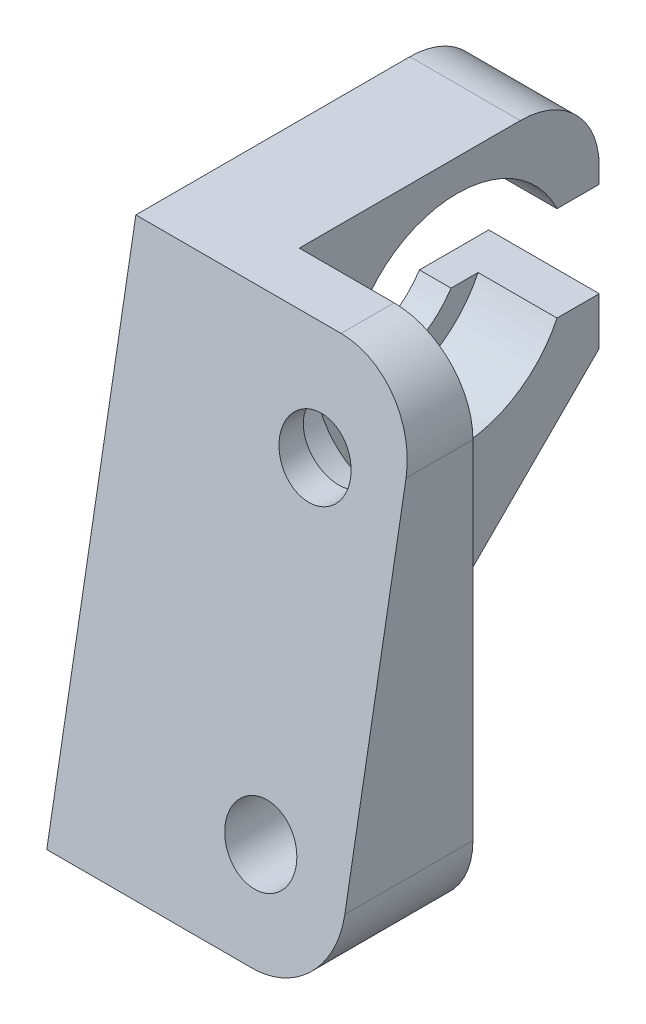
ISO-10303-21;
HEADER;
FILE_DESCRIPTION(('STEP AP214'),'2;1');
FILE_NAME('part.step','',(''),(''),'','','');
FILE_SCHEMA(('AUTOMOTIVE_DESIGN { 1 0 10303 214 1 1 1 1 }'));
ENDSEC;
DATA;
#1=APPLICATION_CONTEXT('core data for automotive mechanical design processes');
#2=APPLICATION_PROTOCOL_DEFINITION('international standard','automotive_design',2000,#1);
#3=PRODUCT_CONTEXT('',#1,'mechanical');
#4=PRODUCT('Part','Part','',(#3));
#5=PRODUCT_RELATED_PRODUCT_CATEGORY('part','',(#4));
#6=PRODUCT_DEFINITION_FORMATION('','',#4);
#7=PRODUCT_DEFINITION_CONTEXT('part definition',#1,'design');
#8=PRODUCT_DEFINITION('design','',#6,#7);
#9=PRODUCT_DEFINITION_SHAPE('','',#8);
#10=(LENGTH_UNIT() NAMED_UNIT(*) SI_UNIT(.MILLI.,.METRE.));
#11=(NAMED_UNIT(*) PLANE_ANGLE_UNIT() SI_UNIT($,.RADIAN.));
#12=(NAMED_UNIT(*) SI_UNIT($,.STERADIAN.) SOLID_ANGLE_UNIT());
#13=UNCERTAINTY_MEASURE_WITH_UNIT(LENGTH_MEASURE(1.E-05),#10,'distance_accuracy_value','');
#14=(GEOMETRIC_REPRESENTATION_CONTEXT(3) GLOBAL_UNCERTAINTY_ASSIGNED_CONTEXT((#13)) GLOBAL_UNIT_ASSIGNED_CONTEXT((#10,
#11,#12)) REPRESENTATION_CONTEXT('',''));
#15=CARTESIAN_POINT('',(0.,0.,0.));
#16=DIRECTION('',(0.,0.,1.));
#17=DIRECTION('',(1.,0.,0.));
#18=AXIS2_PLACEMENT_3D('',#15,#16,#17);
#19=CARTESIAN_POINT('',(18.,32.,-28.));
#20=DIRECTION('',(0.,0.,1.));
#21=DIRECTION('',(0.,-1.,0.));
#22=AXIS2_PLACEMENT_3D('',#19,#20,#21);
#23=PLANE('',#22);
#24=DIRECTION('',(0.,1.,0.));
#25=VECTOR('',#24,1.);
#26=CARTESIAN_POINT('',(0.,32.,-28.));
#27=LINE('',#26,#25);
#28=CARTESIAN_POINT('',(0.,26.,-28.));
#29=VERTEX_POINT('',#28);
#30=CARTESIAN_POINT('',(0.,27.,-28.));
#31=VERTEX_POINT('',#30);
#32=EDGE_CURVE('E159',#29,#31,#27,.T.);
#33=ORIENTED_EDGE('',*,*,#32,.T.);
#34=DIRECTION('',(-1.,0.,0.));
#35=VECTOR('',#34,1.);
#36=CARTESIAN_POINT('',(18.,27.,-28.));
#37=LINE('',#36,#35);
#38=CARTESIAN_POINT('',(7.,27.,-28.));
#39=VERTEX_POINT('',#38);
#40=EDGE_CURVE('E278',#31,#39,#37,.F.);
#41=ORIENTED_EDGE('',*,*,#40,.T.);
#42=DIRECTION('',(0.,1.,0.));
#43=VECTOR('',#42,1.);
#44=CARTESIAN_POINT('',(7.,0.,-28.));
#45=LINE('',#44,#43);
#46=CARTESIAN_POINT('',(7.,26.,-28.));
#47=VERTEX_POINT('',#46);
#48=EDGE_CURVE('E234',#47,#39,#45,.T.);
#49=ORIENTED_EDGE('',*,*,#48,.F.);
#50=DIRECTION('',(1.,0.,0.));
#51=VECTOR('',#50,1.);
#52=CARTESIAN_POINT('',(0.,26.,-28.));
#53=LINE('',#52,#51);
#54=EDGE_CURVE('E168',#29,#47,#53,.T.);
#55=ORIENTED_EDGE('',*,*,#54,.F.);
#56=EDGE_LOOP('',(#33,#41,#49,#55));
#57=FACE_BOUND('',#56,.T.);
#58=ADVANCED_FACE('F35',(#57),#23,.F.);
#59=CARTESIAN_POINT('',(0.,23.,-19.));
#60=DIRECTION('',(1.,0.,0.));
#61=DIRECTION('',(0.,0.,-1.));
#62=AXIS2_PLACEMENT_3D('',#59,#60,#61);
#63=CYLINDRICAL_SURFACE('',#62,5.5);
#64=CARTESIAN_POINT('',(0.,23.,-19.));
#65=DIRECTION('',(1.,0.,0.));
#66=DIRECTION('',(0.,0.,-1.));
#67=AXIS2_PLACEMENT_3D('',#64,#65,#66);
#68=CIRCLE('',#67,5.5);
#69=CARTESIAN_POINT('',(0.,26.,-23.6097722286464));
#70=VERTEX_POINT('',#69);
#71=CARTESIAN_POINT('',(0.,20.,-23.6097722286464));
#72=VERTEX_POINT('',#71);
#73=EDGE_CURVE('E176',#70,#72,#68,.T.);
#74=ORIENTED_EDGE('',*,*,#73,.F.);
#75=DIRECTION('',(1.,0.,0.));
#76=VECTOR('',#75,1.);
#77=CARTESIAN_POINT('',(0.,26.,-23.6097722286464));
#78=LINE('',#77,#76);
#79=CARTESIAN_POINT('',(2.,26.,-23.6097722286464));
#80=VERTEX_POINT('',#79);
#81=EDGE_CURVE('E190',#70,#80,#78,.T.);
#82=ORIENTED_EDGE('',*,*,#81,.T.);
#83=CARTESIAN_POINT('',(2.,23.,-19.));
#84=DIRECTION('',(1.,0.,0.));
#85=DIRECTION('',(0.,0.,-1.));
#86=AXIS2_PLACEMENT_3D('',#83,#84,#85);
#87=CIRCLE('',#86,5.5);
#88=CARTESIAN_POINT('',(2.,20.,-23.6097722286464));
#89=VERTEX_POINT('',#88);
#90=EDGE_CURVE('E197',#89,#80,#87,.F.);
#91=ORIENTED_EDGE('',*,*,#90,.F.);
#92=DIRECTION('',(1.,0.,0.));
#93=VECTOR('',#92,1.);
#94=CARTESIAN_POINT('',(0.,20.,-23.6097722286464));
#95=LINE('',#94,#93);
#96=EDGE_CURVE('E186',#89,#72,#95,.F.);
#97=ORIENTED_EDGE('',*,*,#96,.T.);
#98=EDGE_LOOP('',(#74,#82,#91,#97));
#99=FACE_BOUND('',#98,.T.);
#100=ADVANCED_FACE('F327',(#99),#63,.F.);
#101=CARTESIAN_POINT('',(18.,0.,-28.));
#102=DIRECTION('',(0.,1.,0.));
#103=DIRECTION('',(0.,0.,1.));
#104=AXIS2_PLACEMENT_3D('',#101,#102,#103);
#105=PLANE('',#104);
#106=DIRECTION('',(1.,0.,0.));
#107=VECTOR('',#106,1.);
#108=CARTESIAN_POINT('',(7.,0.,-9.));
#109=LINE('',#108,#107);
#110=CARTESIAN_POINT('',(7.,0.,-9.));
#111=VERTEX_POINT('',#110);
#112=CARTESIAN_POINT('',(13.,0.,-9.));
#113=VERTEX_POINT('',#112);
#114=EDGE_CURVE('E223',#111,#113,#109,.T.);
#115=ORIENTED_EDGE('',*,*,#114,.T.);
#116=DIRECTION('',(0.,0.,-1.));
#117=VECTOR('',#116,1.);
#118=CARTESIAN_POINT('',(13.,0.,0.));
#119=LINE('',#118,#117);
#120=CARTESIAN_POINT('',(13.,0.,0.));
#121=VERTEX_POINT('',#120);
#122=EDGE_CURVE('E58',#113,#121,#119,.F.);
#123=ORIENTED_EDGE('',*,*,#122,.T.);
#124=DIRECTION('',(-1.,0.,0.));
#125=VECTOR('',#124,1.);
#126=CARTESIAN_POINT('',(18.,0.,0.));
#127=LINE('',#126,#125);
#128=CARTESIAN_POINT('',(0.,0.,0.));
#129=VERTEX_POINT('',#128);
#130=EDGE_CURVE('E243',#121,#129,#127,.T.);
#131=ORIENTED_EDGE('',*,*,#130,.T.);
#132=DIRECTION('',(0.,0.,-1.));
#133=VECTOR('',#132,1.);
#134=CARTESIAN_POINT('',(0.,0.,-28.));
#135=LINE('',#134,#133);
#136=CARTESIAN_POINT('',(0.,0.,-10.9999999999999));
#137=VERTEX_POINT('',#136);
#138=EDGE_CURVE('E233',#129,#137,#135,.T.);
#139=ORIENTED_EDGE('',*,*,#138,.T.);
#140=DIRECTION('',(1.,0.,0.));
#141=VECTOR('',#140,1.);
#142=CARTESIAN_POINT('',(18.,0.,-10.9999999999999));
#143=LINE('',#142,#141);
#144=CARTESIAN_POINT('',(7.,0.,-10.9999999999999));
#145=VERTEX_POINT('',#144);
#146=EDGE_CURVE('E269',#137,#145,#143,.T.);
#147=ORIENTED_EDGE('',*,*,#146,.T.);
#148=DIRECTION('',(0.,0.,1.));
#149=VECTOR('',#148,1.);
#150=CARTESIAN_POINT('',(7.,0.,-28.));
#151=LINE('',#150,#149);
#152=EDGE_CURVE('E221',#145,#111,#151,.T.);
#153=ORIENTED_EDGE('',*,*,#152,.T.);
#154=EDGE_LOOP('',(#115,#123,#131,#139,#147,#153));
#155=FACE_BOUND('',#154,.T.);
#156=ADVANCED_FACE('F305',(#155),#105,.F.);
#157=CARTESIAN_POINT('',(7.,17.,-28.));
#158=VERTEX_POINT('',#157);
#159=CARTESIAN_POINT('',(7.,20.,-28.));
#160=VERTEX_POINT('',#159);
#161=EDGE_CURVE('E231',#158,#160,#45,.T.);
#162=ORIENTED_EDGE('',*,*,#161,.F.);
#163=DIRECTION('',(-1.,0.,0.));
#164=VECTOR('',#163,1.);
#165=CARTESIAN_POINT('',(18.,17.,-28.));
#166=LINE('',#165,#164);
#167=CARTESIAN_POINT('',(0.,17.,-28.));
#168=VERTEX_POINT('',#167);
#169=EDGE_CURVE('E155',#158,#168,#166,.T.);
#170=ORIENTED_EDGE('',*,*,#169,.T.);
#171=CARTESIAN_POINT('',(0.,20.,-28.));
#172=VERTEX_POINT('',#171);
#173=EDGE_CURVE('E149',#168,#172,#27,.T.);
#174=ORIENTED_EDGE('',*,*,#173,.T.);
#175=DIRECTION('',(1.,0.,0.));
#176=VECTOR('',#175,1.);
#177=CARTESIAN_POINT('',(0.,20.,-28.));
#178=LINE('',#177,#176);
#179=EDGE_CURVE('E153',#172,#160,#178,.T.);
#180=ORIENTED_EDGE('',*,*,#179,.T.);
#181=EDGE_LOOP('',(#162,#170,#174,#180));
#182=FACE_BOUND('',#181,.T.);
#183=ADVANCED_FACE('F152',(#182),#23,.F.);
#184=CARTESIAN_POINT('',(18.,32.,-5.64246338267089));
#185=DIRECTION('',(0.,-1.,0.));
#186=DIRECTION('',(0.,0.,-1.));
#187=AXIS2_PLACEMENT_3D('',#184,#185,#186);
#188=PLANE('',#187);
#189=DIRECTION('',(-1.,0.,0.));
#190=VECTOR('',#189,1.);
#191=CARTESIAN_POINT('',(18.,32.,-5.64246338267089));
#192=LINE('',#191,#190);
#193=CARTESIAN_POINT('',(13.,32.,-5.64246338267089));
#194=VERTEX_POINT('',#193);
#195=CARTESIAN_POINT('',(0.,32.,-5.64246338267089));
#196=VERTEX_POINT('',#195);
#197=EDGE_CURVE('E252',#194,#196,#192,.T.);
#198=ORIENTED_EDGE('',*,*,#197,.F.);
#199=DIRECTION('',(0.,0.,1.));
#200=VECTOR('',#199,1.);
#201=CARTESIAN_POINT('',(13.,32.,-9.));
#202=LINE('',#201,#200);
#203=CARTESIAN_POINT('',(13.,32.,-9.));
#204=VERTEX_POINT('',#203);
#205=EDGE_CURVE('E11',#194,#204,#202,.F.);
#206=ORIENTED_EDGE('',*,*,#205,.T.);
#207=DIRECTION('',(1.,0.,0.));
#208=VECTOR('',#207,1.);
#209=CARTESIAN_POINT('',(7.,32.,-9.));
#210=LINE('',#209,#208);
#211=CARTESIAN_POINT('',(7.,32.,-9.));
#212=VERTEX_POINT('',#211);
#213=EDGE_CURVE('E224',#212,#204,#210,.T.);
#214=ORIENTED_EDGE('',*,*,#213,.F.);
#215=DIRECTION('',(0.,0.,1.));
#216=VECTOR('',#215,1.);
#217=CARTESIAN_POINT('',(7.,32.,-28.));
#218=LINE('',#217,#216);
#219=CARTESIAN_POINT('',(7.,32.,-23.));
#220=VERTEX_POINT('',#219);
#221=EDGE_CURVE('E227',#220,#212,#218,.T.);
#222=ORIENTED_EDGE('',*,*,#221,.F.);
#223=DIRECTION('',(-1.,0.,0.));
#224=VECTOR('',#223,1.);
#225=CARTESIAN_POINT('',(18.,32.,-23.));
#226=LINE('',#225,#224);
#227=CARTESIAN_POINT('',(0.,32.,-23.));
#228=VERTEX_POINT('',#227);
#229=EDGE_CURVE('E273',#220,#228,#226,.T.);
#230=ORIENTED_EDGE('',*,*,#229,.T.);
#231=DIRECTION('',(0.,0.,1.));
#232=VECTOR('',#231,1.);
#233=CARTESIAN_POINT('',(0.,32.,-5.64246338267089));
#234=LINE('',#233,#232);
#235=EDGE_CURVE('E158',#228,#196,#234,.T.);
#236=ORIENTED_EDGE('',*,*,#235,.T.);
#237=EDGE_LOOP('',(#198,#206,#214,#222,#230,#236));
#238=FACE_BOUND('',#237,.T.);
#239=ADVANCED_FACE('F317',(#238),#188,.F.);
#240=CARTESIAN_POINT('',(18.,0.,0.));
#241=DIRECTION('',(0.,-0.173648177666931,-0.984807753012208));
#242=DIRECTION('',(0.,0.984807753012208,-0.173648177666931));
#243=AXIS2_PLACEMENT_3D('',#240,#241,#242);
#244=PLANE('',#243);
#245=CARTESIAN_POINT('',(12.5,25.5,-4.49633800806587));
#246=DIRECTION('',(0.,-0.173648177666931,-0.984807753012208));
#247=DIRECTION('',(0.,0.984807753012208,-0.173648177666931));
#248=AXIS2_PLACEMENT_3D('',#245,#246,#247);
#249=ELLIPSE('',#248,2.28470987674293,2.25);
#250=CARTESIAN_POINT('',(12.5,27.75,-4.89307371465991));
#251=VERTEX_POINT('',#250);
#252=EDGE_CURVE('E210',#251,#251,#249,.T.);
#253=ORIENTED_EDGE('',*,*,#252,.T.);
#254=EDGE_LOOP('',(#253));
#255=FACE_BOUND('',#254,.T.);
#256=CARTESIAN_POINT('',(12.5,6.,-1.05796188425079));
#257=DIRECTION('',(0.,-0.173648177666931,-0.984807753012208));
#258=DIRECTION('',(0.,0.984807753012208,-0.173648177666931));
#259=AXIS2_PLACEMENT_3D('',#256,#257,#258);
#260=ELLIPSE('',#259,2.28470987674292,2.25);
#261=CARTESIAN_POINT('',(12.5,8.25,-1.45469759084484));
#262=VERTEX_POINT('',#261);
#263=EDGE_CURVE('E220',#262,#262,#260,.T.);
#264=ORIENTED_EDGE('',*,*,#263,.T.);
#265=EDGE_LOOP('',(#264));
#266=FACE_BOUND('',#265,.T.);
#267=ORIENTED_EDGE('',*,*,#130,.F.);
#268=CARTESIAN_POINT('',(13.,5.,-0.881634903542327));
#269=DIRECTION('',(0.,-0.173648177666931,-0.984807753012208));
#270=DIRECTION('',(0.,-0.984807753012208,0.173648177666931));
#271=AXIS2_PLACEMENT_3D('',#268,#269,#270);
#272=ELLIPSE('',#271,5.07713305942872,5.);
#273=CARTESIAN_POINT('',(18.,5.,-0.881634903542327));
#274=VERTEX_POINT('',#273);
#275=EDGE_CURVE('E43',#121,#274,#272,.F.);
#276=ORIENTED_EDGE('',*,*,#275,.T.);
#277=DIRECTION('',(0.,-0.984807753012208,0.173648177666931));
#278=VECTOR('',#277,1.);
#279=CARTESIAN_POINT('',(18.,0.,0.));
#280=LINE('',#279,#278);
#281=CARTESIAN_POINT('',(18.,27.,-4.76082847912857));
#282=VERTEX_POINT('',#281);
#283=EDGE_CURVE('E240',#282,#274,#280,.T.);
#284=ORIENTED_EDGE('',*,*,#283,.F.);
#285=CARTESIAN_POINT('',(13.,27.,-4.76082847912857));
#286=DIRECTION('',(0.,-0.173648177666931,-0.984807753012208));
#287=DIRECTION('',(0.,0.984807753012208,-0.173648177666931));
#288=AXIS2_PLACEMENT_3D('',#285,#286,#287);
#289=ELLIPSE('',#288,5.07713305942872,5.);
#290=EDGE_CURVE('E50',#282,#194,#289,.F.);
#291=ORIENTED_EDGE('',*,*,#290,.T.);
#292=ORIENTED_EDGE('',*,*,#197,.T.);
#293=DIRECTION('',(0.,-0.984807753012208,0.173648177666931));
#294=VECTOR('',#293,1.);
#295=CARTESIAN_POINT('',(0.,0.,0.));
#296=LINE('',#295,#294);
#297=EDGE_CURVE('E244',#196,#129,#296,.T.);
#298=ORIENTED_EDGE('',*,*,#297,.T.);
#299=EDGE_LOOP('',(#267,#276,#284,#291,#292,#298));
#300=FACE_BOUND('',#299,.T.);
#301=ADVANCED_FACE('F294',(#255,#266,#300),#244,.F.);
#302=CARTESIAN_POINT('',(18.,0.,0.));
#303=DIRECTION('',(1.,0.,0.));
#304=DIRECTION('',(0.,0.,-1.));
#305=AXIS2_PLACEMENT_3D('',#302,#303,#304);
#306=PLANE('',#305);
#307=ORIENTED_EDGE('',*,*,#283,.T.);
#308=DIRECTION('',(0.,0.,-1.));
#309=VECTOR('',#308,1.);
#310=CARTESIAN_POINT('',(18.,5.,-9.));
#311=LINE('',#310,#309);
#312=CARTESIAN_POINT('',(18.,5.,-9.));
#313=VERTEX_POINT('',#312);
#314=EDGE_CURVE('E285',#274,#313,#311,.T.);
#315=ORIENTED_EDGE('',*,*,#314,.T.);
#316=DIRECTION('',(0.,1.,0.));
#317=VECTOR('',#316,1.);
#318=CARTESIAN_POINT('',(18.,0.,-9.));
#319=LINE('',#318,#317);
#320=CARTESIAN_POINT('',(18.,27.,-9.));
#321=VERTEX_POINT('',#320);
#322=EDGE_CURVE('E235',#313,#321,#319,.T.);
#323=ORIENTED_EDGE('',*,*,#322,.T.);
#324=DIRECTION('',(0.,0.,1.));
#325=VECTOR('',#324,1.);
#326=CARTESIAN_POINT('',(18.,27.,-5.64246338267089));
#327=LINE('',#326,#325);
#328=EDGE_CURVE('E282',#321,#282,#327,.T.);
#329=ORIENTED_EDGE('',*,*,#328,.T.);
#330=EDGE_LOOP('',(#307,#315,#323,#329));
#331=FACE_BOUND('',#330,.T.);
#332=ADVANCED_FACE('F298',(#331),#306,.T.);
#333=CARTESIAN_POINT('',(0.,0.,0.));
#334=DIRECTION('',(1.,0.,0.));
#335=DIRECTION('',(0.,0.,-1.));
#336=AXIS2_PLACEMENT_3D('',#333,#334,#335);
#337=PLANE('',#336);
#338=ORIENTED_EDGE('',*,*,#235,.F.);
#339=CARTESIAN_POINT('',(0.,27.,-23.));
#340=DIRECTION('',(1.,0.,0.));
#341=DIRECTION('',(0.,0.,-1.));
#342=AXIS2_PLACEMENT_3D('',#339,#340,#341);
#343=CIRCLE('',#342,5.);
#344=EDGE_CURVE('E276',#228,#31,#343,.F.);
#345=ORIENTED_EDGE('',*,*,#344,.T.);
#346=ORIENTED_EDGE('',*,*,#32,.F.);
#347=DIRECTION('',(0.,0.,1.));
#348=VECTOR('',#347,1.);
#349=CARTESIAN_POINT('',(0.,26.,-19.));
#350=LINE('',#349,#348);
#351=EDGE_CURVE('E169',#29,#70,#350,.T.);
#352=ORIENTED_EDGE('',*,*,#351,.T.);
#353=ORIENTED_EDGE('',*,*,#73,.T.);
#354=DIRECTION('',(0.,0.,-1.));
#355=VECTOR('',#354,1.);
#356=CARTESIAN_POINT('',(0.,20.,-19.));
#357=LINE('',#356,#355);
#358=EDGE_CURVE('E164',#72,#172,#357,.T.);
#359=ORIENTED_EDGE('',*,*,#358,.T.);
#360=ORIENTED_EDGE('',*,*,#173,.F.);
#361=DIRECTION('',(0.,0.707106781186546,-0.707106781186549));
#362=VECTOR('',#361,1.);
#363=CARTESIAN_POINT('',(0.,17.,-28.));
#364=LINE('',#363,#362);
#365=EDGE_CURVE('E267',#168,#137,#364,.F.);
#366=ORIENTED_EDGE('',*,*,#365,.T.);
#367=ORIENTED_EDGE('',*,*,#138,.F.);
#368=ORIENTED_EDGE('',*,*,#297,.F.);
#369=EDGE_LOOP('',(#338,#345,#346,#352,#353,#359,#360,#366,#367,#368));
#370=FACE_BOUND('',#369,.T.);
#371=ADVANCED_FACE('F173',(#370),#337,.F.);
#372=CARTESIAN_POINT('',(7.,0.,-28.));
#373=DIRECTION('',(-1.,0.,0.));
#374=DIRECTION('',(0.,0.,1.));
#375=AXIS2_PLACEMENT_3D('',#372,#373,#374);
#376=PLANE('',#375);
#377=ORIENTED_EDGE('',*,*,#48,.T.);
#378=CARTESIAN_POINT('',(7.,27.,-23.));
#379=DIRECTION('',(-1.,0.,0.));
#380=DIRECTION('',(0.,0.,1.));
#381=AXIS2_PLACEMENT_3D('',#378,#379,#380);
#382=CIRCLE('',#381,5.);
#383=EDGE_CURVE('E280',#39,#220,#382,.F.);
#384=ORIENTED_EDGE('',*,*,#383,.T.);
#385=ORIENTED_EDGE('',*,*,#221,.T.);
#386=DIRECTION('',(0.,1.,0.));
#387=VECTOR('',#386,1.);
#388=CARTESIAN_POINT('',(7.,0.,-9.));
#389=LINE('',#388,#387);
#390=EDGE_CURVE('E226',#111,#212,#389,.T.);
#391=ORIENTED_EDGE('',*,*,#390,.F.);
#392=ORIENTED_EDGE('',*,*,#152,.F.);
#393=DIRECTION('',(0.,-0.707106781186546,0.707106781186549));
#394=VECTOR('',#393,1.);
#395=CARTESIAN_POINT('',(7.,17.,-28.));
#396=LINE('',#395,#394);
#397=EDGE_CURVE('E271',#145,#158,#396,.F.);
#398=ORIENTED_EDGE('',*,*,#397,.T.);
#399=ORIENTED_EDGE('',*,*,#161,.T.);
#400=DIRECTION('',(0.,0.,-1.));
#401=VECTOR('',#400,1.);
#402=CARTESIAN_POINT('',(7.,20.,-19.));
#403=LINE('',#402,#401);
#404=CARTESIAN_POINT('',(7.,20.,-25.3245553203368));
#405=VERTEX_POINT('',#404);
#406=EDGE_CURVE('E167',#405,#160,#403,.T.);
#407=ORIENTED_EDGE('',*,*,#406,.F.);
#408=CARTESIAN_POINT('',(7.,23.,-19.));
#409=DIRECTION('',(1.,0.,0.));
#410=DIRECTION('',(0.,0.,-1.));
#411=AXIS2_PLACEMENT_3D('',#408,#409,#410);
#412=CIRCLE('',#411,7.);
#413=CARTESIAN_POINT('',(7.,26.,-25.3245553203368));
#414=VERTEX_POINT('',#413);
#415=EDGE_CURVE('E193',#414,#405,#412,.T.);
#416=ORIENTED_EDGE('',*,*,#415,.F.);
#417=DIRECTION('',(0.,0.,1.));
#418=VECTOR('',#417,1.);
#419=CARTESIAN_POINT('',(7.,26.,-19.));
#420=LINE('',#419,#418);
#421=EDGE_CURVE('E177',#47,#414,#420,.T.);
#422=ORIENTED_EDGE('',*,*,#421,.F.);
#423=EDGE_LOOP('',(#377,#384,#385,#391,#392,#398,#399,#407,#416,#422));
#424=FACE_BOUND('',#423,.T.);
#425=ADVANCED_FACE('F312',(#424),#376,.F.);
#426=CARTESIAN_POINT('',(7.,0.,-9.));
#427=DIRECTION('',(0.,0.,1.));
#428=DIRECTION('',(1.,0.,0.));
#429=AXIS2_PLACEMENT_3D('',#426,#427,#428);
#430=PLANE('',#429);
#431=CARTESIAN_POINT('',(12.5,25.5,-9.));
#432=DIRECTION('',(0.,0.,-1.));
#433=DIRECTION('',(-1.,0.,0.));
#434=AXIS2_PLACEMENT_3D('',#431,#432,#433);
#435=CIRCLE('',#434,4.5);
#436=CARTESIAN_POINT('',(8.,25.5,-9.));
#437=VERTEX_POINT('',#436);
#438=EDGE_CURVE('E201',#437,#437,#435,.T.);
#439=ORIENTED_EDGE('',*,*,#438,.F.);
#440=EDGE_LOOP('',(#439));
#441=FACE_BOUND('',#440,.T.);
#442=CARTESIAN_POINT('',(12.5,6.,-9.));
#443=DIRECTION('',(0.,0.,-1.));
#444=DIRECTION('',(-1.,0.,0.));
#445=AXIS2_PLACEMENT_3D('',#442,#443,#444);
#446=CIRCLE('',#445,3.99999999999999);
#447=CARTESIAN_POINT('',(8.50000000000001,6.,-9.));
#448=VERTEX_POINT('',#447);
#449=EDGE_CURVE('E211',#448,#448,#446,.T.);
#450=ORIENTED_EDGE('',*,*,#449,.F.);
#451=EDGE_LOOP('',(#450));
#452=FACE_BOUND('',#451,.T.);
#453=ORIENTED_EDGE('',*,*,#322,.F.);
#454=CARTESIAN_POINT('',(13.,5.,-9.));
#455=DIRECTION('',(0.,0.,1.));
#456=DIRECTION('',(1.,0.,0.));
#457=AXIS2_PLACEMENT_3D('',#454,#455,#456);
#458=CIRCLE('',#457,5.);
#459=EDGE_CURVE('E290',#313,#113,#458,.F.);
#460=ORIENTED_EDGE('',*,*,#459,.T.);
#461=ORIENTED_EDGE('',*,*,#114,.F.);
#462=ORIENTED_EDGE('',*,*,#390,.T.);
#463=ORIENTED_EDGE('',*,*,#213,.T.);
#464=CARTESIAN_POINT('',(13.,27.,-9.));
#465=DIRECTION('',(0.,0.,1.));
#466=DIRECTION('',(1.,0.,0.));
#467=AXIS2_PLACEMENT_3D('',#464,#465,#466);
#468=CIRCLE('',#467,5.);
#469=EDGE_CURVE('E288',#204,#321,#468,.F.);
#470=ORIENTED_EDGE('',*,*,#469,.T.);
#471=EDGE_LOOP('',(#453,#460,#461,#462,#463,#470));
#472=FACE_BOUND('',#471,.T.);
#473=ADVANCED_FACE('F304',(#441,#452,#472),#430,.F.);
#474=CARTESIAN_POINT('',(12.5,6.,-9.));
#475=DIRECTION('',(0.,0.,-1.));
#476=DIRECTION('',(-1.,0.,0.));
#477=AXIS2_PLACEMENT_3D('',#474,#475,#476);
#478=CYLINDRICAL_SURFACE('',#477,2.25);
#479=CARTESIAN_POINT('',(12.5,6.,-4.6));
#480=DIRECTION('',(0.,0.,-1.));
#481=DIRECTION('',(-1.,0.,0.));
#482=AXIS2_PLACEMENT_3D('',#479,#480,#481);
#483=CIRCLE('',#482,2.25);
#484=CARTESIAN_POINT('',(10.25,6.,-4.6));
#485=VERTEX_POINT('',#484);
#486=EDGE_CURVE('E217',#485,#485,#483,.T.);
#487=ORIENTED_EDGE('',*,*,#486,.T.);
#488=EDGE_LOOP('',(#487));
#489=FACE_BOUND('',#488,.T.);
#490=ORIENTED_EDGE('',*,*,#263,.F.);
#491=EDGE_LOOP('',(#490));
#492=FACE_BOUND('',#491,.T.);
#493=ADVANCED_FACE('F401',(#489,#492),#478,.F.);
#494=CARTESIAN_POINT('',(14.75,6.,-4.6));
#495=DIRECTION('',(0.,0.,1.));
#496=DIRECTION('',(1.,0.,0.));
#497=AXIS2_PLACEMENT_3D('',#494,#495,#496);
#498=PLANE('',#497);
#499=ORIENTED_EDGE('',*,*,#486,.F.);
#500=EDGE_LOOP('',(#499));
#501=FACE_BOUND('',#500,.T.);
#502=CARTESIAN_POINT('',(12.5,6.,-4.6));
#503=DIRECTION('',(0.,0.,-1.));
#504=DIRECTION('',(-1.,0.,0.));
#505=AXIS2_PLACEMENT_3D('',#502,#503,#504);
#506=CIRCLE('',#505,4.);
#507=CARTESIAN_POINT('',(8.5,6.,-4.6));
#508=VERTEX_POINT('',#507);
#509=EDGE_CURVE('E214',#508,#508,#506,.T.);
#510=ORIENTED_EDGE('',*,*,#509,.T.);
#511=EDGE_LOOP('',(#510));
#512=FACE_BOUND('',#511,.T.);
#513=ADVANCED_FACE('F397',(#501,#512),#498,.F.);
#514=CARTESIAN_POINT('',(12.5,6.,-9.));
#515=DIRECTION('',(0.,0.,-1.));
#516=DIRECTION('',(-1.,0.,0.));
#517=AXIS2_PLACEMENT_3D('',#514,#515,#516);
#518=CYLINDRICAL_SURFACE('',#517,3.99999999999999);
#519=ORIENTED_EDGE('',*,*,#509,.F.);
#520=EDGE_LOOP('',(#519));
#521=FACE_BOUND('',#520,.T.);
#522=ORIENTED_EDGE('',*,*,#449,.T.);
#523=EDGE_LOOP('',(#522));
#524=FACE_BOUND('',#523,.T.);
#525=ADVANCED_FACE('F393',(#521,#524),#518,.F.);
#526=CARTESIAN_POINT('',(12.5,25.5,-9.));
#527=DIRECTION('',(0.,0.,-1.));
#528=DIRECTION('',(-1.,0.,0.));
#529=AXIS2_PLACEMENT_3D('',#526,#527,#528);
#530=CYLINDRICAL_SURFACE('',#529,2.25);
#531=CARTESIAN_POINT('',(12.5,25.5,-6.));
#532=DIRECTION('',(0.,0.,-1.));
#533=DIRECTION('',(-1.,0.,0.));
#534=AXIS2_PLACEMENT_3D('',#531,#532,#533);
#535=CIRCLE('',#534,2.25);
#536=CARTESIAN_POINT('',(10.25,25.5,-6.));
#537=VERTEX_POINT('',#536);
#538=EDGE_CURVE('E207',#537,#537,#535,.T.);
#539=ORIENTED_EDGE('',*,*,#538,.T.);
#540=EDGE_LOOP('',(#539));
#541=FACE_BOUND('',#540,.T.);
#542=ORIENTED_EDGE('',*,*,#252,.F.);
#543=EDGE_LOOP('',(#542));
#544=FACE_BOUND('',#543,.T.);
#545=ADVANCED_FACE('F389',(#541,#544),#530,.F.);
#546=CARTESIAN_POINT('',(14.75,25.5,-6.));
#547=DIRECTION('',(0.,0.,1.));
#548=DIRECTION('',(1.,0.,0.));
#549=AXIS2_PLACEMENT_3D('',#546,#547,#548);
#550=PLANE('',#549);
#551=ORIENTED_EDGE('',*,*,#538,.F.);
#552=EDGE_LOOP('',(#551));
#553=FACE_BOUND('',#552,.T.);
#554=CARTESIAN_POINT('',(12.5,25.5,-6.));
#555=DIRECTION('',(0.,0.,-1.));
#556=DIRECTION('',(-1.,0.,0.));
#557=AXIS2_PLACEMENT_3D('',#554,#555,#556);
#558=CIRCLE('',#557,4.5);
#559=CARTESIAN_POINT('',(8.,25.5,-6.));
#560=VERTEX_POINT('',#559);
#561=EDGE_CURVE('E204',#560,#560,#558,.T.);
#562=ORIENTED_EDGE('',*,*,#561,.T.);
#563=EDGE_LOOP('',(#562));
#564=FACE_BOUND('',#563,.T.);
#565=ADVANCED_FACE('F381',(#553,#564),#550,.F.);
#566=CARTESIAN_POINT('',(12.5,25.5,-9.));
#567=DIRECTION('',(0.,0.,-1.));
#568=DIRECTION('',(-1.,0.,0.));
#569=AXIS2_PLACEMENT_3D('',#566,#567,#568);
#570=CYLINDRICAL_SURFACE('',#569,4.5);
#571=ORIENTED_EDGE('',*,*,#561,.F.);
#572=EDGE_LOOP('',(#571));
#573=FACE_BOUND('',#572,.T.);
#574=ORIENTED_EDGE('',*,*,#438,.T.);
#575=EDGE_LOOP('',(#574));
#576=FACE_BOUND('',#575,.T.);
#577=ADVANCED_FACE('F374',(#573,#576),#570,.F.);
#578=CARTESIAN_POINT('',(2.,23.,-19.));
#579=DIRECTION('',(1.,0.,0.));
#580=DIRECTION('',(0.,0.,-1.));
#581=AXIS2_PLACEMENT_3D('',#578,#579,#580);
#582=PLANE('',#581);
#583=DIRECTION('',(0.,0.,1.));
#584=VECTOR('',#583,1.);
#585=CARTESIAN_POINT('',(2.,26.,-19.));
#586=LINE('',#585,#584);
#587=CARTESIAN_POINT('',(2.,26.,-25.3245553203368));
#588=VERTEX_POINT('',#587);
#589=EDGE_CURVE('E188',#588,#80,#586,.T.);
#590=ORIENTED_EDGE('',*,*,#589,.F.);
#591=CARTESIAN_POINT('',(2.,23.,-19.));
#592=DIRECTION('',(1.,0.,0.));
#593=DIRECTION('',(0.,0.,-1.));
#594=AXIS2_PLACEMENT_3D('',#591,#592,#593);
#595=CIRCLE('',#594,7.);
#596=CARTESIAN_POINT('',(2.,20.,-25.3245553203368));
#597=VERTEX_POINT('',#596);
#598=EDGE_CURVE('E194',#588,#597,#595,.T.);
#599=ORIENTED_EDGE('',*,*,#598,.T.);
#600=DIRECTION('',(0.,0.,-1.));
#601=VECTOR('',#600,1.);
#602=CARTESIAN_POINT('',(2.,20.,-19.));
#603=LINE('',#602,#601);
#604=EDGE_CURVE('E183',#89,#597,#603,.T.);
#605=ORIENTED_EDGE('',*,*,#604,.F.);
#606=ORIENTED_EDGE('',*,*,#90,.T.);
#607=EDGE_LOOP('',(#590,#599,#605,#606));
#608=FACE_BOUND('',#607,.T.);
#609=ADVANCED_FACE('F370',(#608),#582,.T.);
#610=CARTESIAN_POINT('',(2.,23.,-19.));
#611=DIRECTION('',(1.,0.,0.));
#612=DIRECTION('',(0.,0.,-1.));
#613=AXIS2_PLACEMENT_3D('',#610,#611,#612);
#614=CYLINDRICAL_SURFACE('',#613,7.);
#615=ORIENTED_EDGE('',*,*,#598,.F.);
#616=DIRECTION('',(1.,0.,0.));
#617=VECTOR('',#616,1.);
#618=CARTESIAN_POINT('',(2.,26.,-25.3245553203368));
#619=LINE('',#618,#617);
#620=EDGE_CURVE('E263',#588,#414,#619,.T.);
#621=ORIENTED_EDGE('',*,*,#620,.T.);
#622=ORIENTED_EDGE('',*,*,#415,.T.);
#623=DIRECTION('',(1.,0.,0.));
#624=VECTOR('',#623,1.);
#625=CARTESIAN_POINT('',(2.,20.,-25.3245553203368));
#626=LINE('',#625,#624);
#627=EDGE_CURVE('E254',#405,#597,#626,.F.);
#628=ORIENTED_EDGE('',*,*,#627,.T.);
#629=EDGE_LOOP('',(#615,#621,#622,#628));
#630=FACE_BOUND('',#629,.T.);
#631=ADVANCED_FACE('F366',(#630),#614,.F.);
#632=CARTESIAN_POINT('',(0.,20.,-19.));
#633=DIRECTION('',(0.,-1.,0.));
#634=DIRECTION('',(0.,0.,-1.));
#635=AXIS2_PLACEMENT_3D('',#632,#633,#634);
#636=PLANE('',#635);
#637=ORIENTED_EDGE('',*,*,#604,.T.);
#638=ORIENTED_EDGE('',*,*,#627,.F.);
#639=ORIENTED_EDGE('',*,*,#406,.T.);
#640=ORIENTED_EDGE('',*,*,#179,.F.);
#641=ORIENTED_EDGE('',*,*,#358,.F.);
#642=ORIENTED_EDGE('',*,*,#96,.F.);
#643=EDGE_LOOP('',(#637,#638,#639,#640,#641,#642));
#644=FACE_BOUND('',#643,.T.);
#645=ADVANCED_FACE('F163',(#644),#636,.F.);
#646=CARTESIAN_POINT('',(0.,26.,-19.));
#647=DIRECTION('',(0.,1.,0.));
#648=DIRECTION('',(0.,0.,1.));
#649=AXIS2_PLACEMENT_3D('',#646,#647,#648);
#650=PLANE('',#649);
#651=ORIENTED_EDGE('',*,*,#351,.F.);
#652=ORIENTED_EDGE('',*,*,#54,.T.);
#653=ORIENTED_EDGE('',*,*,#421,.T.);
#654=ORIENTED_EDGE('',*,*,#620,.F.);
#655=ORIENTED_EDGE('',*,*,#589,.T.);
#656=ORIENTED_EDGE('',*,*,#81,.F.);
#657=EDGE_LOOP('',(#651,#652,#653,#654,#655,#656));
#658=FACE_BOUND('',#657,.T.);
#659=ADVANCED_FACE('F349',(#658),#650,.F.);
#660=CARTESIAN_POINT('',(18.,17.,-28.));
#661=DIRECTION('',(0.,0.707106781186549,0.707106781186546));
#662=DIRECTION('',(-1.,0.,0.));
#663=AXIS2_PLACEMENT_3D('',#660,#661,#662);
#664=PLANE('',#663);
#665=ORIENTED_EDGE('',*,*,#397,.F.);
#666=ORIENTED_EDGE('',*,*,#146,.F.);
#667=ORIENTED_EDGE('',*,*,#365,.F.);
#668=ORIENTED_EDGE('',*,*,#169,.F.);
#669=EDGE_LOOP('',(#665,#666,#667,#668));
#670=FACE_BOUND('',#669,.T.);
#671=ADVANCED_FACE('F346',(#670),#664,.F.);
#672=CARTESIAN_POINT('',(18.,27.,-23.));
#673=DIRECTION('',(-1.,0.,0.));
#674=DIRECTION('',(0.,0.,1.));
#675=AXIS2_PLACEMENT_3D('',#672,#673,#674);
#676=CYLINDRICAL_SURFACE('',#675,5.);
#677=ORIENTED_EDGE('',*,*,#383,.F.);
#678=ORIENTED_EDGE('',*,*,#40,.F.);
#679=ORIENTED_EDGE('',*,*,#344,.F.);
#680=ORIENTED_EDGE('',*,*,#229,.F.);
#681=EDGE_LOOP('',(#677,#678,#679,#680));
#682=FACE_BOUND('',#681,.T.);
#683=ADVANCED_FACE('F325',(#682),#676,.T.);
#684=CARTESIAN_POINT('',(13.,5.,0.));
#685=DIRECTION('',(0.,0.,1.));
#686=DIRECTION('',(0.,-1.,0.));
#687=AXIS2_PLACEMENT_3D('',#684,#685,#686);
#688=CYLINDRICAL_SURFACE('',#687,5.);
#689=ORIENTED_EDGE('',*,*,#275,.F.);
#690=ORIENTED_EDGE('',*,*,#122,.F.);
#691=ORIENTED_EDGE('',*,*,#459,.F.);
#692=ORIENTED_EDGE('',*,*,#314,.F.);
#693=EDGE_LOOP('',(#689,#690,#691,#692));
#694=FACE_BOUND('',#693,.T.);
#695=ADVANCED_FACE('F301',(#694),#688,.T.);
#696=CARTESIAN_POINT('',(13.,27.,0.));
#697=DIRECTION('',(0.,0.,-1.));
#698=DIRECTION('',(-1.,0.,0.));
#699=AXIS2_PLACEMENT_3D('',#696,#697,#698);
#700=CYLINDRICAL_SURFACE('',#699,5.);
#701=ORIENTED_EDGE('',*,*,#469,.F.);
#702=ORIENTED_EDGE('',*,*,#205,.F.);
#703=ORIENTED_EDGE('',*,*,#290,.F.);
#704=ORIENTED_EDGE('',*,*,#328,.F.);
#705=EDGE_LOOP('',(#701,#702,#703,#704));
#706=FACE_BOUND('',#705,.T.);
#707=ADVANCED_FACE('F37',(#706),#700,.T.);
#708=CLOSED_SHELL('',(#58,#100,#156,#183,#239,#301,#332,#371,#425,#473,#493,#513,#525,#545,#565,
#577,#609,#631,#645,#659,#671,#683,#695,#707));
#709=MANIFOLD_SOLID_BREP('B2',#708);
#710=ADVANCED_BREP_SHAPE_REPRESENTATION('',(#18,#709),#14);
#711=SHAPE_DEFINITION_REPRESENTATION(#9,#710);
ENDSEC;
END-ISO-10303-21;
